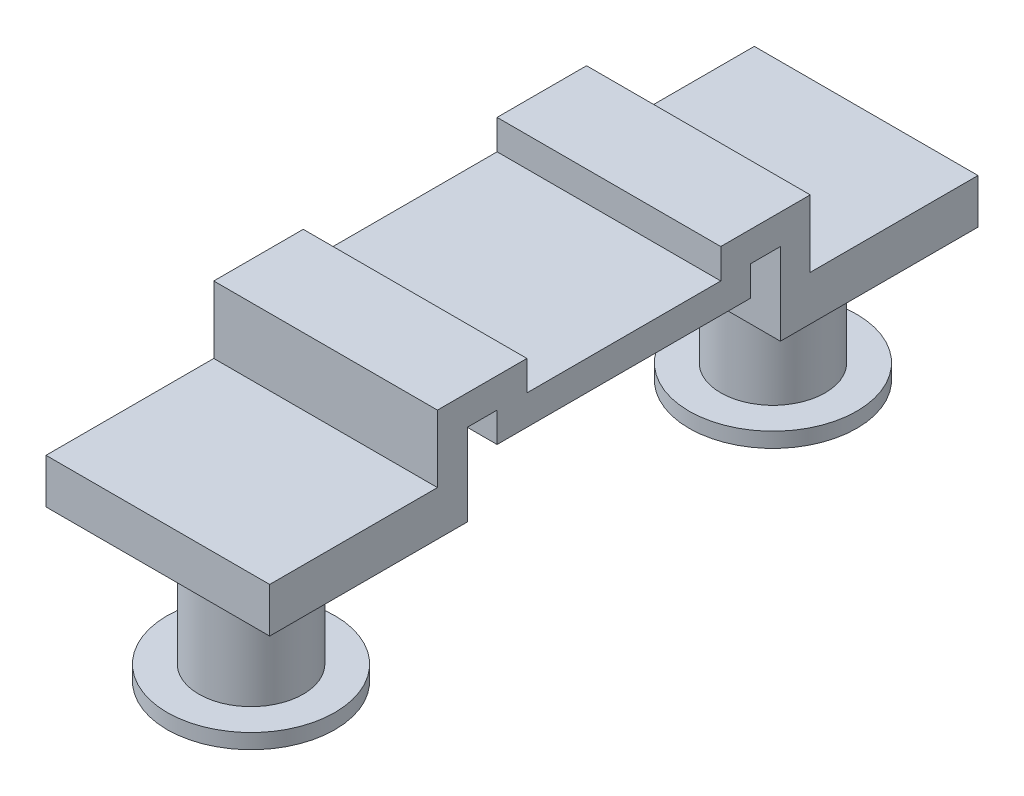
ISO-10303-21;
HEADER;
FILE_DESCRIPTION(('STEP AP214'),'2;1');
FILE_NAME('part.step','',(''),(''),'','','');
FILE_SCHEMA(('AUTOMOTIVE_DESIGN { 1 0 10303 214 1 1 1 1 }'));
ENDSEC;
DATA;
#1=APPLICATION_CONTEXT('core data for automotive mechanical design processes');
#2=APPLICATION_PROTOCOL_DEFINITION('international standard','automotive_design',2000,#1);
#3=PRODUCT_CONTEXT('',#1,'mechanical');
#4=PRODUCT('Part','Part','',(#3));
#5=PRODUCT_RELATED_PRODUCT_CATEGORY('part','',(#4));
#6=PRODUCT_DEFINITION_FORMATION('','',#4);
#7=PRODUCT_DEFINITION_CONTEXT('part definition',#1,'design');
#8=PRODUCT_DEFINITION('design','',#6,#7);
#9=PRODUCT_DEFINITION_SHAPE('','',#8);
#10=(LENGTH_UNIT() NAMED_UNIT(*) SI_UNIT(.MILLI.,.METRE.));
#11=(NAMED_UNIT(*) PLANE_ANGLE_UNIT() SI_UNIT($,.RADIAN.));
#12=(NAMED_UNIT(*) SI_UNIT($,.STERADIAN.) SOLID_ANGLE_UNIT());
#13=UNCERTAINTY_MEASURE_WITH_UNIT(LENGTH_MEASURE(1.E-05),#10,'distance_accuracy_value','');
#14=(GEOMETRIC_REPRESENTATION_CONTEXT(3) GLOBAL_UNCERTAINTY_ASSIGNED_CONTEXT((#13)) GLOBAL_UNIT_ASSIGNED_CONTEXT((#10,
#11,#12)) REPRESENTATION_CONTEXT('',''));
#15=CARTESIAN_POINT('',(0.,0.,0.));
#16=DIRECTION('',(0.,0.,1.));
#17=DIRECTION('',(1.,0.,0.));
#18=AXIS2_PLACEMENT_3D('',#15,#16,#17);
#19=CARTESIAN_POINT('',(3.,-1.,9.5));
#20=DIRECTION('',(0.,-1.,0.));
#21=DIRECTION('',(0.,0.,-1.));
#22=AXIS2_PLACEMENT_3D('',#19,#20,#21);
#23=PLANE('',#22);
#24=DIRECTION('',(0.,0.,1.));
#25=VECTOR('',#24,1.);
#26=CARTESIAN_POINT('',(-3.,-1.,9.5));
#27=LINE('',#26,#25);
#28=CARTESIAN_POINT('',(-3.,-1.,5.));
#29=VERTEX_POINT('',#28);
#30=CARTESIAN_POINT('',(-3.,-1.,9.5));
#31=VERTEX_POINT('',#30);
#32=EDGE_CURVE('E206',#29,#31,#27,.T.);
#33=ORIENTED_EDGE('',*,*,#32,.T.);
#34=DIRECTION('',(-1.,0.,0.));
#35=VECTOR('',#34,1.);
#36=CARTESIAN_POINT('',(3.,-1.,9.5));
#37=LINE('',#36,#35);
#38=CARTESIAN_POINT('',(3.,-1.,9.5));
#39=VERTEX_POINT('',#38);
#40=EDGE_CURVE('E11',#39,#31,#37,.T.);
#41=ORIENTED_EDGE('',*,*,#40,.F.);
#42=DIRECTION('',(0.,0.,1.));
#43=VECTOR('',#42,1.);
#44=CARTESIAN_POINT('',(3.,-1.,9.5));
#45=LINE('',#44,#43);
#46=CARTESIAN_POINT('',(3.,-1.,5.));
#47=VERTEX_POINT('',#46);
#48=EDGE_CURVE('E244',#47,#39,#45,.T.);
#49=ORIENTED_EDGE('',*,*,#48,.F.);
#50=DIRECTION('',(-1.,0.,0.));
#51=VECTOR('',#50,1.);
#52=CARTESIAN_POINT('',(3.,-1.,5.));
#53=LINE('',#52,#51);
#54=EDGE_CURVE('E202',#47,#29,#53,.T.);
#55=ORIENTED_EDGE('',*,*,#54,.T.);
#56=EDGE_LOOP('',(#33,#41,#49,#55));
#57=FACE_BOUND('',#56,.T.);
#58=ADVANCED_FACE('F37',(#57),#23,.F.);
#59=CARTESIAN_POINT('',(3.,-2.2,9.5));
#60=DIRECTION('',(0.,0.,-1.));
#61=DIRECTION('',(-1.,0.,0.));
#62=AXIS2_PLACEMENT_3D('',#59,#60,#61);
#63=PLANE('',#62);
#64=DIRECTION('',(0.,-1.,0.));
#65=VECTOR('',#64,1.);
#66=CARTESIAN_POINT('',(-3.,-2.2,9.5));
#67=LINE('',#66,#65);
#68=CARTESIAN_POINT('',(-3.,-2.2,9.5));
#69=VERTEX_POINT('',#68);
#70=EDGE_CURVE('E209',#31,#69,#67,.T.);
#71=ORIENTED_EDGE('',*,*,#70,.T.);
#72=DIRECTION('',(-1.,0.,0.));
#73=VECTOR('',#72,1.);
#74=CARTESIAN_POINT('',(3.,-2.2,9.5));
#75=LINE('',#74,#73);
#76=CARTESIAN_POINT('',(3.,-2.2,9.5));
#77=VERTEX_POINT('',#76);
#78=EDGE_CURVE('E46',#77,#69,#75,.T.);
#79=ORIENTED_EDGE('',*,*,#78,.F.);
#80=DIRECTION('',(0.,-1.,0.));
#81=VECTOR('',#80,1.);
#82=CARTESIAN_POINT('',(3.,-2.2,9.5));
#83=LINE('',#82,#81);
#84=EDGE_CURVE('E133',#39,#77,#83,.T.);
#85=ORIENTED_EDGE('',*,*,#84,.F.);
#86=ORIENTED_EDGE('',*,*,#40,.T.);
#87=EDGE_LOOP('',(#71,#79,#85,#86));
#88=FACE_BOUND('',#87,.T.);
#89=ADVANCED_FACE('F363',(#88),#63,.F.);
#90=CARTESIAN_POINT('',(3.,-2.2,4.2));
#91=DIRECTION('',(0.,1.,0.));
#92=DIRECTION('',(0.,0.,1.));
#93=AXIS2_PLACEMENT_3D('',#90,#91,#92);
#94=PLANE('',#93);
#95=CARTESIAN_POINT('',(0.,-2.2,7.));
#96=DIRECTION('',(0.,1.,0.));
#97=DIRECTION('',(0.,0.,1.));
#98=AXIS2_PLACEMENT_3D('',#95,#96,#97);
#99=CIRCLE('',#98,1.4);
#100=CARTESIAN_POINT('',(0.,-2.2,8.4));
#101=VERTEX_POINT('',#100);
#102=EDGE_CURVE('E40',#101,#101,#99,.T.);
#103=ORIENTED_EDGE('',*,*,#102,.T.);
#104=EDGE_LOOP('',(#103));
#105=FACE_BOUND('',#104,.T.);
#106=DIRECTION('',(0.,0.,-1.));
#107=VECTOR('',#106,1.);
#108=CARTESIAN_POINT('',(-3.,-2.2,4.2));
#109=LINE('',#108,#107);
#110=CARTESIAN_POINT('',(-3.,-2.2,4.2));
#111=VERTEX_POINT('',#110);
#112=EDGE_CURVE('E211',#69,#111,#109,.T.);
#113=ORIENTED_EDGE('',*,*,#112,.T.);
#114=DIRECTION('',(-1.,0.,0.));
#115=VECTOR('',#114,1.);
#116=CARTESIAN_POINT('',(3.,-2.2,4.2));
#117=LINE('',#116,#115);
#118=CARTESIAN_POINT('',(3.,-2.2,4.2));
#119=VERTEX_POINT('',#118);
#120=EDGE_CURVE('E287',#119,#111,#117,.T.);
#121=ORIENTED_EDGE('',*,*,#120,.F.);
#122=DIRECTION('',(0.,0.,-1.));
#123=VECTOR('',#122,1.);
#124=CARTESIAN_POINT('',(3.,-2.2,4.2));
#125=LINE('',#124,#123);
#126=EDGE_CURVE('E296',#77,#119,#125,.T.);
#127=ORIENTED_EDGE('',*,*,#126,.F.);
#128=ORIENTED_EDGE('',*,*,#78,.T.);
#129=EDGE_LOOP('',(#113,#121,#127,#128));
#130=FACE_BOUND('',#129,.T.);
#131=ADVANCED_FACE('F294',(#105,#130),#94,.F.);
#132=CARTESIAN_POINT('',(3.,0.,4.2));
#133=DIRECTION('',(0.,0.,1.));
#134=DIRECTION('',(1.,0.,0.));
#135=AXIS2_PLACEMENT_3D('',#132,#133,#134);
#136=PLANE('',#135);
#137=DIRECTION('',(0.,1.,0.));
#138=VECTOR('',#137,1.);
#139=CARTESIAN_POINT('',(-3.,0.,4.2));
#140=LINE('',#139,#138);
#141=CARTESIAN_POINT('',(-3.,0.,4.2));
#142=VERTEX_POINT('',#141);
#143=EDGE_CURVE('E213',#111,#142,#140,.T.);
#144=ORIENTED_EDGE('',*,*,#143,.T.);
#145=DIRECTION('',(-1.,0.,0.));
#146=VECTOR('',#145,1.);
#147=CARTESIAN_POINT('',(3.,0.,4.2));
#148=LINE('',#147,#146);
#149=CARTESIAN_POINT('',(3.,0.,4.2));
#150=VERTEX_POINT('',#149);
#151=EDGE_CURVE('E284',#150,#142,#148,.T.);
#152=ORIENTED_EDGE('',*,*,#151,.F.);
#153=DIRECTION('',(0.,1.,0.));
#154=VECTOR('',#153,1.);
#155=CARTESIAN_POINT('',(3.,0.,4.2));
#156=LINE('',#155,#154);
#157=EDGE_CURVE('E314',#119,#150,#156,.T.);
#158=ORIENTED_EDGE('',*,*,#157,.F.);
#159=ORIENTED_EDGE('',*,*,#120,.T.);
#160=EDGE_LOOP('',(#144,#152,#158,#159));
#161=FACE_BOUND('',#160,.T.);
#162=ADVANCED_FACE('F305',(#161),#136,.F.);
#163=CARTESIAN_POINT('',(3.,0.,4.2));
#164=DIRECTION('',(0.,1.,0.));
#165=DIRECTION('',(0.,0.,1.));
#166=AXIS2_PLACEMENT_3D('',#163,#164,#165);
#167=PLANE('',#166);
#168=DIRECTION('',(0.,0.,-1.));
#169=VECTOR('',#168,1.);
#170=CARTESIAN_POINT('',(-3.,0.,4.2));
#171=LINE('',#170,#169);
#172=CARTESIAN_POINT('',(-3.,0.,3.4));
#173=VERTEX_POINT('',#172);
#174=EDGE_CURVE('E215',#142,#173,#171,.T.);
#175=ORIENTED_EDGE('',*,*,#174,.T.);
#176=DIRECTION('',(-1.,0.,0.));
#177=VECTOR('',#176,1.);
#178=CARTESIAN_POINT('',(3.,0.,3.4));
#179=LINE('',#178,#177);
#180=CARTESIAN_POINT('',(3.,0.,3.4));
#181=VERTEX_POINT('',#180);
#182=EDGE_CURVE('E281',#181,#173,#179,.T.);
#183=ORIENTED_EDGE('',*,*,#182,.F.);
#184=DIRECTION('',(0.,0.,-1.));
#185=VECTOR('',#184,1.);
#186=CARTESIAN_POINT('',(3.,0.,4.2));
#187=LINE('',#186,#185);
#188=EDGE_CURVE('E311',#150,#181,#187,.T.);
#189=ORIENTED_EDGE('',*,*,#188,.F.);
#190=ORIENTED_EDGE('',*,*,#151,.T.);
#191=EDGE_LOOP('',(#175,#183,#189,#190));
#192=FACE_BOUND('',#191,.T.);
#193=ADVANCED_FACE('F309',(#192),#167,.F.);
#194=CARTESIAN_POINT('',(3.,0.,3.4));
#195=DIRECTION('',(0.,0.,-1.));
#196=DIRECTION('',(-1.,0.,0.));
#197=AXIS2_PLACEMENT_3D('',#194,#195,#196);
#198=PLANE('',#197);
#199=DIRECTION('',(0.,-1.,0.));
#200=VECTOR('',#199,1.);
#201=CARTESIAN_POINT('',(-3.,0.,3.4));
#202=LINE('',#201,#200);
#203=CARTESIAN_POINT('',(-3.,-0.799999999999999,3.4));
#204=VERTEX_POINT('',#203);
#205=EDGE_CURVE('E217',#173,#204,#202,.T.);
#206=ORIENTED_EDGE('',*,*,#205,.T.);
#207=DIRECTION('',(-1.,0.,0.));
#208=VECTOR('',#207,1.);
#209=CARTESIAN_POINT('',(3.,-0.799999999999999,3.4));
#210=LINE('',#209,#208);
#211=CARTESIAN_POINT('',(3.,-0.799999999999999,3.4));
#212=VERTEX_POINT('',#211);
#213=EDGE_CURVE('E278',#212,#204,#210,.T.);
#214=ORIENTED_EDGE('',*,*,#213,.F.);
#215=DIRECTION('',(0.,-1.,0.));
#216=VECTOR('',#215,1.);
#217=CARTESIAN_POINT('',(3.,0.,3.4));
#218=LINE('',#217,#216);
#219=EDGE_CURVE('E313',#181,#212,#218,.T.);
#220=ORIENTED_EDGE('',*,*,#219,.F.);
#221=ORIENTED_EDGE('',*,*,#182,.T.);
#222=EDGE_LOOP('',(#206,#214,#220,#221));
#223=FACE_BOUND('',#222,.T.);
#224=ADVANCED_FACE('F377',(#223),#198,.F.);
#225=CARTESIAN_POINT('',(3.,-0.799999999999999,3.4));
#226=DIRECTION('',(0.,1.,0.));
#227=DIRECTION('',(0.,0.,1.));
#228=AXIS2_PLACEMENT_3D('',#225,#226,#227);
#229=PLANE('',#228);
#230=DIRECTION('',(0.,0.,-1.));
#231=VECTOR('',#230,1.);
#232=CARTESIAN_POINT('',(-3.,-0.799999999999999,3.4));
#233=LINE('',#232,#231);
#234=CARTESIAN_POINT('',(-3.,-0.799999999999999,-3.4));
#235=VERTEX_POINT('',#234);
#236=EDGE_CURVE('E219',#204,#235,#233,.T.);
#237=ORIENTED_EDGE('',*,*,#236,.T.);
#238=DIRECTION('',(-1.,0.,0.));
#239=VECTOR('',#238,1.);
#240=CARTESIAN_POINT('',(3.,-0.799999999999999,-3.4));
#241=LINE('',#240,#239);
#242=CARTESIAN_POINT('',(3.,-0.799999999999999,-3.4));
#243=VERTEX_POINT('',#242);
#244=EDGE_CURVE('E275',#243,#235,#241,.T.);
#245=ORIENTED_EDGE('',*,*,#244,.F.);
#246=DIRECTION('',(0.,0.,-1.));
#247=VECTOR('',#246,1.);
#248=CARTESIAN_POINT('',(3.,-0.799999999999999,3.4));
#249=LINE('',#248,#247);
#250=EDGE_CURVE('E316',#212,#243,#249,.T.);
#251=ORIENTED_EDGE('',*,*,#250,.F.);
#252=ORIENTED_EDGE('',*,*,#213,.T.);
#253=EDGE_LOOP('',(#237,#245,#251,#252));
#254=FACE_BOUND('',#253,.T.);
#255=ADVANCED_FACE('F380',(#254),#229,.F.);
#256=CARTESIAN_POINT('',(3.,0.,-3.4));
#257=DIRECTION('',(0.,0.,1.));
#258=DIRECTION('',(1.,0.,0.));
#259=AXIS2_PLACEMENT_3D('',#256,#257,#258);
#260=PLANE('',#259);
#261=DIRECTION('',(0.,1.,0.));
#262=VECTOR('',#261,1.);
#263=CARTESIAN_POINT('',(-3.,0.,-3.4));
#264=LINE('',#263,#262);
#265=CARTESIAN_POINT('',(-3.,0.,-3.4));
#266=VERTEX_POINT('',#265);
#267=EDGE_CURVE('E221',#235,#266,#264,.T.);
#268=ORIENTED_EDGE('',*,*,#267,.T.);
#269=DIRECTION('',(-1.,0.,0.));
#270=VECTOR('',#269,1.);
#271=CARTESIAN_POINT('',(3.,0.,-3.4));
#272=LINE('',#271,#270);
#273=CARTESIAN_POINT('',(3.,0.,-3.4));
#274=VERTEX_POINT('',#273);
#275=EDGE_CURVE('E272',#274,#266,#272,.T.);
#276=ORIENTED_EDGE('',*,*,#275,.F.);
#277=DIRECTION('',(0.,1.,0.));
#278=VECTOR('',#277,1.);
#279=CARTESIAN_POINT('',(3.,0.,-3.4));
#280=LINE('',#279,#278);
#281=EDGE_CURVE('E322',#243,#274,#280,.T.);
#282=ORIENTED_EDGE('',*,*,#281,.F.);
#283=ORIENTED_EDGE('',*,*,#244,.T.);
#284=EDGE_LOOP('',(#268,#276,#282,#283));
#285=FACE_BOUND('',#284,.T.);
#286=ADVANCED_FACE('F384',(#285),#260,.F.);
#287=CARTESIAN_POINT('',(3.,0.,-4.2));
#288=DIRECTION('',(0.,1.,0.));
#289=DIRECTION('',(0.,0.,1.));
#290=AXIS2_PLACEMENT_3D('',#287,#288,#289);
#291=PLANE('',#290);
#292=DIRECTION('',(0.,0.,-1.));
#293=VECTOR('',#292,1.);
#294=CARTESIAN_POINT('',(-3.,0.,-4.2));
#295=LINE('',#294,#293);
#296=CARTESIAN_POINT('',(-3.,0.,-4.2));
#297=VERTEX_POINT('',#296);
#298=EDGE_CURVE('E223',#266,#297,#295,.T.);
#299=ORIENTED_EDGE('',*,*,#298,.T.);
#300=DIRECTION('',(-1.,0.,0.));
#301=VECTOR('',#300,1.);
#302=CARTESIAN_POINT('',(3.,0.,-4.2));
#303=LINE('',#302,#301);
#304=CARTESIAN_POINT('',(3.,0.,-4.2));
#305=VERTEX_POINT('',#304);
#306=EDGE_CURVE('E269',#305,#297,#303,.T.);
#307=ORIENTED_EDGE('',*,*,#306,.F.);
#308=DIRECTION('',(0.,0.,-1.));
#309=VECTOR('',#308,1.);
#310=CARTESIAN_POINT('',(3.,0.,-4.2));
#311=LINE('',#310,#309);
#312=EDGE_CURVE('E324',#274,#305,#311,.T.);
#313=ORIENTED_EDGE('',*,*,#312,.F.);
#314=ORIENTED_EDGE('',*,*,#275,.T.);
#315=EDGE_LOOP('',(#299,#307,#313,#314));
#316=FACE_BOUND('',#315,.T.);
#317=ADVANCED_FACE('F388',(#316),#291,.F.);
#318=CARTESIAN_POINT('',(3.,0.,-4.2));
#319=DIRECTION('',(0.,0.,-1.));
#320=DIRECTION('',(-1.,0.,0.));
#321=AXIS2_PLACEMENT_3D('',#318,#319,#320);
#322=PLANE('',#321);
#323=DIRECTION('',(0.,-1.,0.));
#324=VECTOR('',#323,1.);
#325=CARTESIAN_POINT('',(-3.,0.,-4.2));
#326=LINE('',#325,#324);
#327=CARTESIAN_POINT('',(-3.,-2.2,-4.2));
#328=VERTEX_POINT('',#327);
#329=EDGE_CURVE('E225',#297,#328,#326,.T.);
#330=ORIENTED_EDGE('',*,*,#329,.T.);
#331=DIRECTION('',(-1.,0.,0.));
#332=VECTOR('',#331,1.);
#333=CARTESIAN_POINT('',(3.,-2.2,-4.2));
#334=LINE('',#333,#332);
#335=CARTESIAN_POINT('',(3.,-2.2,-4.2));
#336=VERTEX_POINT('',#335);
#337=EDGE_CURVE('E266',#336,#328,#334,.T.);
#338=ORIENTED_EDGE('',*,*,#337,.F.);
#339=DIRECTION('',(0.,-1.,0.));
#340=VECTOR('',#339,1.);
#341=CARTESIAN_POINT('',(3.,0.,-4.2));
#342=LINE('',#341,#340);
#343=EDGE_CURVE('E326',#305,#336,#342,.T.);
#344=ORIENTED_EDGE('',*,*,#343,.F.);
#345=ORIENTED_EDGE('',*,*,#306,.T.);
#346=EDGE_LOOP('',(#330,#338,#344,#345));
#347=FACE_BOUND('',#346,.T.);
#348=ADVANCED_FACE('F392',(#347),#322,.F.);
#349=CARTESIAN_POINT('',(3.,-2.2,-4.2));
#350=DIRECTION('',(0.,1.,0.));
#351=DIRECTION('',(0.,0.,1.));
#352=AXIS2_PLACEMENT_3D('',#349,#350,#351);
#353=PLANE('',#352);
#354=CARTESIAN_POINT('',(0.,-2.2,-7.));
#355=DIRECTION('',(0.,1.,0.));
#356=DIRECTION('',(0.,0.,1.));
#357=AXIS2_PLACEMENT_3D('',#354,#355,#356);
#358=CIRCLE('',#357,1.4);
#359=CARTESIAN_POINT('',(0.,-2.2,-5.6));
#360=VERTEX_POINT('',#359);
#361=EDGE_CURVE('E712',#360,#360,#358,.T.);
#362=ORIENTED_EDGE('',*,*,#361,.T.);
#363=EDGE_LOOP('',(#362));
#364=FACE_BOUND('',#363,.T.);
#365=DIRECTION('',(0.,0.,-1.));
#366=VECTOR('',#365,1.);
#367=CARTESIAN_POINT('',(-3.,-2.2,-4.2));
#368=LINE('',#367,#366);
#369=CARTESIAN_POINT('',(-3.,-2.2,-9.5));
#370=VERTEX_POINT('',#369);
#371=EDGE_CURVE('E227',#328,#370,#368,.T.);
#372=ORIENTED_EDGE('',*,*,#371,.T.);
#373=DIRECTION('',(-1.,0.,0.));
#374=VECTOR('',#373,1.);
#375=CARTESIAN_POINT('',(3.,-2.2,-9.5));
#376=LINE('',#375,#374);
#377=CARTESIAN_POINT('',(3.,-2.2,-9.5));
#378=VERTEX_POINT('',#377);
#379=EDGE_CURVE('E263',#378,#370,#376,.T.);
#380=ORIENTED_EDGE('',*,*,#379,.F.);
#381=DIRECTION('',(0.,0.,-1.));
#382=VECTOR('',#381,1.);
#383=CARTESIAN_POINT('',(3.,-2.2,-4.2));
#384=LINE('',#383,#382);
#385=EDGE_CURVE('E328',#336,#378,#384,.T.);
#386=ORIENTED_EDGE('',*,*,#385,.F.);
#387=ORIENTED_EDGE('',*,*,#337,.T.);
#388=EDGE_LOOP('',(#372,#380,#386,#387));
#389=FACE_BOUND('',#388,.T.);
#390=ADVANCED_FACE('F396',(#364,#389),#353,.F.);
#391=CARTESIAN_POINT('',(3.,-2.2,-9.5));
#392=DIRECTION('',(0.,0.,1.));
#393=DIRECTION('',(1.,0.,0.));
#394=AXIS2_PLACEMENT_3D('',#391,#392,#393);
#395=PLANE('',#394);
#396=DIRECTION('',(0.,1.,0.));
#397=VECTOR('',#396,1.);
#398=CARTESIAN_POINT('',(-3.,-2.2,-9.5));
#399=LINE('',#398,#397);
#400=CARTESIAN_POINT('',(-3.,-1.,-9.5));
#401=VERTEX_POINT('',#400);
#402=EDGE_CURVE('E229',#370,#401,#399,.T.);
#403=ORIENTED_EDGE('',*,*,#402,.T.);
#404=DIRECTION('',(-1.,0.,0.));
#405=VECTOR('',#404,1.);
#406=CARTESIAN_POINT('',(3.,-1.,-9.5));
#407=LINE('',#406,#405);
#408=CARTESIAN_POINT('',(3.,-1.,-9.5));
#409=VERTEX_POINT('',#408);
#410=EDGE_CURVE('E260',#409,#401,#407,.T.);
#411=ORIENTED_EDGE('',*,*,#410,.F.);
#412=DIRECTION('',(0.,1.,0.));
#413=VECTOR('',#412,1.);
#414=CARTESIAN_POINT('',(3.,-2.2,-9.5));
#415=LINE('',#414,#413);
#416=EDGE_CURVE('E330',#378,#409,#415,.T.);
#417=ORIENTED_EDGE('',*,*,#416,.F.);
#418=ORIENTED_EDGE('',*,*,#379,.T.);
#419=EDGE_LOOP('',(#403,#411,#417,#418));
#420=FACE_BOUND('',#419,.T.);
#421=ADVANCED_FACE('F400',(#420),#395,.F.);
#422=CARTESIAN_POINT('',(3.,-1.,-9.5));
#423=DIRECTION('',(0.,-1.,0.));
#424=DIRECTION('',(0.,0.,-1.));
#425=AXIS2_PLACEMENT_3D('',#422,#423,#424);
#426=PLANE('',#425);
#427=DIRECTION('',(0.,0.,1.));
#428=VECTOR('',#427,1.);
#429=CARTESIAN_POINT('',(-3.,-1.,-9.5));
#430=LINE('',#429,#428);
#431=CARTESIAN_POINT('',(-3.,-1.,-5.));
#432=VERTEX_POINT('',#431);
#433=EDGE_CURVE('E231',#401,#432,#430,.T.);
#434=ORIENTED_EDGE('',*,*,#433,.T.);
#435=DIRECTION('',(-1.,0.,0.));
#436=VECTOR('',#435,1.);
#437=CARTESIAN_POINT('',(3.,-1.,-5.));
#438=LINE('',#437,#436);
#439=CARTESIAN_POINT('',(3.,-1.,-5.));
#440=VERTEX_POINT('',#439);
#441=EDGE_CURVE('E257',#440,#432,#438,.T.);
#442=ORIENTED_EDGE('',*,*,#441,.F.);
#443=DIRECTION('',(0.,0.,1.));
#444=VECTOR('',#443,1.);
#445=CARTESIAN_POINT('',(3.,-1.,-9.5));
#446=LINE('',#445,#444);
#447=EDGE_CURVE('E332',#409,#440,#446,.T.);
#448=ORIENTED_EDGE('',*,*,#447,.F.);
#449=ORIENTED_EDGE('',*,*,#410,.T.);
#450=EDGE_LOOP('',(#434,#442,#448,#449));
#451=FACE_BOUND('',#450,.T.);
#452=ADVANCED_FACE('F404',(#451),#426,.F.);
#453=CARTESIAN_POINT('',(3.,-1.,-5.));
#454=DIRECTION('',(0.,0.,1.));
#455=DIRECTION('',(1.,0.,0.));
#456=AXIS2_PLACEMENT_3D('',#453,#454,#455);
#457=PLANE('',#456);
#458=DIRECTION('',(0.,1.,0.));
#459=VECTOR('',#458,1.);
#460=CARTESIAN_POINT('',(-3.,-1.,-5.));
#461=LINE('',#460,#459);
#462=CARTESIAN_POINT('',(-3.,0.8,-5.));
#463=VERTEX_POINT('',#462);
#464=EDGE_CURVE('E233',#432,#463,#461,.T.);
#465=ORIENTED_EDGE('',*,*,#464,.T.);
#466=DIRECTION('',(-1.,0.,0.));
#467=VECTOR('',#466,1.);
#468=CARTESIAN_POINT('',(3.,0.8,-5.));
#469=LINE('',#468,#467);
#470=CARTESIAN_POINT('',(3.,0.8,-5.));
#471=VERTEX_POINT('',#470);
#472=EDGE_CURVE('E254',#471,#463,#469,.T.);
#473=ORIENTED_EDGE('',*,*,#472,.F.);
#474=DIRECTION('',(0.,1.,0.));
#475=VECTOR('',#474,1.);
#476=CARTESIAN_POINT('',(3.,-1.,-5.));
#477=LINE('',#476,#475);
#478=EDGE_CURVE('E334',#440,#471,#477,.T.);
#479=ORIENTED_EDGE('',*,*,#478,.F.);
#480=ORIENTED_EDGE('',*,*,#441,.T.);
#481=EDGE_LOOP('',(#465,#473,#479,#480));
#482=FACE_BOUND('',#481,.T.);
#483=ADVANCED_FACE('F408',(#482),#457,.F.);
#484=CARTESIAN_POINT('',(3.,0.8,-5.));
#485=DIRECTION('',(0.,-1.,0.));
#486=DIRECTION('',(0.,0.,-1.));
#487=AXIS2_PLACEMENT_3D('',#484,#485,#486);
#488=PLANE('',#487);
#489=DIRECTION('',(0.,0.,1.));
#490=VECTOR('',#489,1.);
#491=CARTESIAN_POINT('',(-3.,0.8,-5.));
#492=LINE('',#491,#490);
#493=CARTESIAN_POINT('',(-3.,0.8,-2.6));
#494=VERTEX_POINT('',#493);
#495=EDGE_CURVE('E235',#463,#494,#492,.T.);
#496=ORIENTED_EDGE('',*,*,#495,.T.);
#497=DIRECTION('',(-1.,0.,0.));
#498=VECTOR('',#497,1.);
#499=CARTESIAN_POINT('',(3.,0.8,-2.6));
#500=LINE('',#499,#498);
#501=CARTESIAN_POINT('',(3.,0.8,-2.6));
#502=VERTEX_POINT('',#501);
#503=EDGE_CURVE('E251',#502,#494,#500,.T.);
#504=ORIENTED_EDGE('',*,*,#503,.F.);
#505=DIRECTION('',(0.,0.,1.));
#506=VECTOR('',#505,1.);
#507=CARTESIAN_POINT('',(3.,0.8,-5.));
#508=LINE('',#507,#506);
#509=EDGE_CURVE('E336',#471,#502,#508,.T.);
#510=ORIENTED_EDGE('',*,*,#509,.F.);
#511=ORIENTED_EDGE('',*,*,#472,.T.);
#512=EDGE_LOOP('',(#496,#504,#510,#511));
#513=FACE_BOUND('',#512,.T.);
#514=ADVANCED_FACE('F412',(#513),#488,.F.);
#515=CARTESIAN_POINT('',(3.,0.8,-2.6));
#516=DIRECTION('',(0.,0.,-1.));
#517=DIRECTION('',(-1.,0.,0.));
#518=AXIS2_PLACEMENT_3D('',#515,#516,#517);
#519=PLANE('',#518);
#520=DIRECTION('',(0.,-1.,0.));
#521=VECTOR('',#520,1.);
#522=CARTESIAN_POINT('',(-3.,0.8,-2.6));
#523=LINE('',#522,#521);
#524=CARTESIAN_POINT('',(-3.,0.,-2.6));
#525=VERTEX_POINT('',#524);
#526=EDGE_CURVE('E237',#494,#525,#523,.T.);
#527=ORIENTED_EDGE('',*,*,#526,.T.);
#528=DIRECTION('',(-1.,0.,0.));
#529=VECTOR('',#528,1.);
#530=CARTESIAN_POINT('',(3.,0.,-2.6));
#531=LINE('',#530,#529);
#532=CARTESIAN_POINT('',(3.,0.,-2.6));
#533=VERTEX_POINT('',#532);
#534=EDGE_CURVE('E248',#533,#525,#531,.T.);
#535=ORIENTED_EDGE('',*,*,#534,.F.);
#536=DIRECTION('',(0.,-1.,0.));
#537=VECTOR('',#536,1.);
#538=CARTESIAN_POINT('',(3.,0.8,-2.6));
#539=LINE('',#538,#537);
#540=EDGE_CURVE('E338',#502,#533,#539,.T.);
#541=ORIENTED_EDGE('',*,*,#540,.F.);
#542=ORIENTED_EDGE('',*,*,#503,.T.);
#543=EDGE_LOOP('',(#527,#535,#541,#542));
#544=FACE_BOUND('',#543,.T.);
#545=ADVANCED_FACE('F344',(#544),#519,.F.);
#546=CARTESIAN_POINT('',(3.,0.,2.6));
#547=DIRECTION('',(0.,-1.,0.));
#548=DIRECTION('',(0.,0.,-1.));
#549=AXIS2_PLACEMENT_3D('',#546,#547,#548);
#550=PLANE('',#549);
#551=DIRECTION('',(0.,0.,1.));
#552=VECTOR('',#551,1.);
#553=CARTESIAN_POINT('',(-3.,0.,2.6));
#554=LINE('',#553,#552);
#555=CARTESIAN_POINT('',(-3.,0.,2.6));
#556=VERTEX_POINT('',#555);
#557=EDGE_CURVE('E239',#525,#556,#554,.T.);
#558=ORIENTED_EDGE('',*,*,#557,.T.);
#559=DIRECTION('',(-1.,0.,0.));
#560=VECTOR('',#559,1.);
#561=CARTESIAN_POINT('',(3.,0.,2.6));
#562=LINE('',#561,#560);
#563=CARTESIAN_POINT('',(3.,0.,2.6));
#564=VERTEX_POINT('',#563);
#565=EDGE_CURVE('E197',#564,#556,#562,.T.);
#566=ORIENTED_EDGE('',*,*,#565,.F.);
#567=DIRECTION('',(0.,0.,1.));
#568=VECTOR('',#567,1.);
#569=CARTESIAN_POINT('',(3.,0.,2.6));
#570=LINE('',#569,#568);
#571=EDGE_CURVE('E188',#533,#564,#570,.T.);
#572=ORIENTED_EDGE('',*,*,#571,.F.);
#573=ORIENTED_EDGE('',*,*,#534,.T.);
#574=EDGE_LOOP('',(#558,#566,#572,#573));
#575=FACE_BOUND('',#574,.T.);
#576=ADVANCED_FACE('F348',(#575),#550,.F.);
#577=CARTESIAN_POINT('',(3.,0.8,2.6));
#578=DIRECTION('',(0.,0.,1.));
#579=DIRECTION('',(1.,0.,0.));
#580=AXIS2_PLACEMENT_3D('',#577,#578,#579);
#581=PLANE('',#580);
#582=DIRECTION('',(0.,1.,0.));
#583=VECTOR('',#582,1.);
#584=CARTESIAN_POINT('',(-3.,0.8,2.6));
#585=LINE('',#584,#583);
#586=CARTESIAN_POINT('',(-3.,0.8,2.6));
#587=VERTEX_POINT('',#586);
#588=EDGE_CURVE('E196',#556,#587,#585,.T.);
#589=ORIENTED_EDGE('',*,*,#588,.T.);
#590=DIRECTION('',(-1.,0.,0.));
#591=VECTOR('',#590,1.);
#592=CARTESIAN_POINT('',(3.,0.8,2.6));
#593=LINE('',#592,#591);
#594=CARTESIAN_POINT('',(3.,0.8,2.6));
#595=VERTEX_POINT('',#594);
#596=EDGE_CURVE('E193',#595,#587,#593,.T.);
#597=ORIENTED_EDGE('',*,*,#596,.F.);
#598=DIRECTION('',(0.,1.,0.));
#599=VECTOR('',#598,1.);
#600=CARTESIAN_POINT('',(3.,0.8,2.6));
#601=LINE('',#600,#599);
#602=EDGE_CURVE('E182',#564,#595,#601,.T.);
#603=ORIENTED_EDGE('',*,*,#602,.F.);
#604=ORIENTED_EDGE('',*,*,#565,.T.);
#605=EDGE_LOOP('',(#589,#597,#603,#604));
#606=FACE_BOUND('',#605,.T.);
#607=ADVANCED_FACE('F194',(#606),#581,.F.);
#608=CARTESIAN_POINT('',(3.,0.8,5.));
#609=DIRECTION('',(0.,-1.,0.));
#610=DIRECTION('',(0.,0.,-1.));
#611=AXIS2_PLACEMENT_3D('',#608,#609,#610);
#612=PLANE('',#611);
#613=DIRECTION('',(0.,0.,1.));
#614=VECTOR('',#613,1.);
#615=CARTESIAN_POINT('',(-3.,0.8,5.));
#616=LINE('',#615,#614);
#617=CARTESIAN_POINT('',(-3.,0.8,5.));
#618=VERTEX_POINT('',#617);
#619=EDGE_CURVE('E119',#587,#618,#616,.T.);
#620=ORIENTED_EDGE('',*,*,#619,.T.);
#621=DIRECTION('',(-1.,0.,0.));
#622=VECTOR('',#621,1.);
#623=CARTESIAN_POINT('',(3.,0.8,5.));
#624=LINE('',#623,#622);
#625=CARTESIAN_POINT('',(3.,0.8,5.));
#626=VERTEX_POINT('',#625);
#627=EDGE_CURVE('E198',#626,#618,#624,.T.);
#628=ORIENTED_EDGE('',*,*,#627,.F.);
#629=DIRECTION('',(0.,0.,1.));
#630=VECTOR('',#629,1.);
#631=CARTESIAN_POINT('',(3.,0.8,5.));
#632=LINE('',#631,#630);
#633=EDGE_CURVE('E186',#595,#626,#632,.T.);
#634=ORIENTED_EDGE('',*,*,#633,.F.);
#635=ORIENTED_EDGE('',*,*,#596,.T.);
#636=EDGE_LOOP('',(#620,#628,#634,#635));
#637=FACE_BOUND('',#636,.T.);
#638=ADVANCED_FACE('F200',(#637),#612,.F.);
#639=CARTESIAN_POINT('',(3.,-1.,5.));
#640=DIRECTION('',(0.,0.,-1.));
#641=DIRECTION('',(-1.,0.,0.));
#642=AXIS2_PLACEMENT_3D('',#639,#640,#641);
#643=PLANE('',#642);
#644=DIRECTION('',(0.,-1.,0.));
#645=VECTOR('',#644,1.);
#646=CARTESIAN_POINT('',(-3.,-1.,5.));
#647=LINE('',#646,#645);
#648=EDGE_CURVE('E125',#618,#29,#647,.T.);
#649=ORIENTED_EDGE('',*,*,#648,.T.);
#650=ORIENTED_EDGE('',*,*,#54,.F.);
#651=DIRECTION('',(0.,-1.,0.));
#652=VECTOR('',#651,1.);
#653=CARTESIAN_POINT('',(3.,-1.,5.));
#654=LINE('',#653,#652);
#655=EDGE_CURVE('E54',#626,#47,#654,.T.);
#656=ORIENTED_EDGE('',*,*,#655,.F.);
#657=ORIENTED_EDGE('',*,*,#627,.T.);
#658=EDGE_LOOP('',(#649,#650,#656,#657));
#659=FACE_BOUND('',#658,.T.);
#660=ADVANCED_FACE('F352',(#659),#643,.F.);
#661=CARTESIAN_POINT('',(3.,0.,0.));
#662=DIRECTION('',(1.,0.,0.));
#663=DIRECTION('',(0.,0.,-1.));
#664=AXIS2_PLACEMENT_3D('',#661,#662,#663);
#665=PLANE('',#664);
#666=ORIENTED_EDGE('',*,*,#48,.T.);
#667=ORIENTED_EDGE('',*,*,#84,.T.);
#668=ORIENTED_EDGE('',*,*,#126,.T.);
#669=ORIENTED_EDGE('',*,*,#157,.T.);
#670=ORIENTED_EDGE('',*,*,#188,.T.);
#671=ORIENTED_EDGE('',*,*,#219,.T.);
#672=ORIENTED_EDGE('',*,*,#250,.T.);
#673=ORIENTED_EDGE('',*,*,#281,.T.);
#674=ORIENTED_EDGE('',*,*,#312,.T.);
#675=ORIENTED_EDGE('',*,*,#343,.T.);
#676=ORIENTED_EDGE('',*,*,#385,.T.);
#677=ORIENTED_EDGE('',*,*,#416,.T.);
#678=ORIENTED_EDGE('',*,*,#447,.T.);
#679=ORIENTED_EDGE('',*,*,#478,.T.);
#680=ORIENTED_EDGE('',*,*,#509,.T.);
#681=ORIENTED_EDGE('',*,*,#540,.T.);
#682=ORIENTED_EDGE('',*,*,#571,.T.);
#683=ORIENTED_EDGE('',*,*,#602,.T.);
#684=ORIENTED_EDGE('',*,*,#633,.T.);
#685=ORIENTED_EDGE('',*,*,#655,.T.);
#686=EDGE_LOOP('',(#666,#667,#668,#669,#670,#671,#672,#673,#674,#675,#676,#677,#678,#679,#680,
#681,#682,#683,#684,#685));
#687=FACE_BOUND('',#686,.T.);
#688=ADVANCED_FACE('F184',(#687),#665,.T.);
#689=CARTESIAN_POINT('',(-3.,0.,0.));
#690=DIRECTION('',(1.,0.,0.));
#691=DIRECTION('',(0.,0.,-1.));
#692=AXIS2_PLACEMENT_3D('',#689,#690,#691);
#693=PLANE('',#692);
#694=ORIENTED_EDGE('',*,*,#32,.F.);
#695=ORIENTED_EDGE('',*,*,#648,.F.);
#696=ORIENTED_EDGE('',*,*,#619,.F.);
#697=ORIENTED_EDGE('',*,*,#588,.F.);
#698=ORIENTED_EDGE('',*,*,#557,.F.);
#699=ORIENTED_EDGE('',*,*,#526,.F.);
#700=ORIENTED_EDGE('',*,*,#495,.F.);
#701=ORIENTED_EDGE('',*,*,#464,.F.);
#702=ORIENTED_EDGE('',*,*,#433,.F.);
#703=ORIENTED_EDGE('',*,*,#402,.F.);
#704=ORIENTED_EDGE('',*,*,#371,.F.);
#705=ORIENTED_EDGE('',*,*,#329,.F.);
#706=ORIENTED_EDGE('',*,*,#298,.F.);
#707=ORIENTED_EDGE('',*,*,#267,.F.);
#708=ORIENTED_EDGE('',*,*,#236,.F.);
#709=ORIENTED_EDGE('',*,*,#205,.F.);
#710=ORIENTED_EDGE('',*,*,#174,.F.);
#711=ORIENTED_EDGE('',*,*,#143,.F.);
#712=ORIENTED_EDGE('',*,*,#112,.F.);
#713=ORIENTED_EDGE('',*,*,#70,.F.);
#714=EDGE_LOOP('',(#694,#695,#696,#697,#698,#699,#700,#701,#702,#703,#704,#705,#706,#707,#708,
#709,#710,#711,#712,#713));
#715=FACE_BOUND('',#714,.T.);
#716=ADVANCED_FACE('F300',(#715),#693,.F.);
#717=CARTESIAN_POINT('',(0.,-5.6,7.));
#718=DIRECTION('',(0.,1.,0.));
#719=DIRECTION('',(0.,0.,1.));
#720=AXIS2_PLACEMENT_3D('',#717,#718,#719);
#721=CYLINDRICAL_SURFACE('',#720,1.4);
#722=CARTESIAN_POINT('',(0.,-5.6,7.));
#723=DIRECTION('',(0.,1.,0.));
#724=DIRECTION('',(0.,0.,1.));
#725=AXIS2_PLACEMENT_3D('',#722,#723,#724);
#726=CIRCLE('',#725,1.4);
#727=CARTESIAN_POINT('',(0.,-5.6,8.4));
#728=VERTEX_POINT('',#727);
#729=EDGE_CURVE('E692',#728,#728,#726,.T.);
#730=ORIENTED_EDGE('',*,*,#729,.T.);
#731=EDGE_LOOP('',(#730));
#732=FACE_BOUND('',#731,.T.);
#733=ORIENTED_EDGE('',*,*,#102,.F.);
#734=EDGE_LOOP('',(#733));
#735=FACE_BOUND('',#734,.T.);
#736=ADVANCED_FACE('F451',(#732,#735),#721,.T.);
#737=CARTESIAN_POINT('',(0.,-5.6,-7.));
#738=DIRECTION('',(0.,1.,0.));
#739=DIRECTION('',(0.,0.,1.));
#740=AXIS2_PLACEMENT_3D('',#737,#738,#739);
#741=CYLINDRICAL_SURFACE('',#740,1.4);
#742=CARTESIAN_POINT('',(0.,-5.6,-7.));
#743=DIRECTION('',(0.,1.,0.));
#744=DIRECTION('',(0.,0.,-1.));
#745=AXIS2_PLACEMENT_3D('',#742,#743,#744);
#746=CIRCLE('',#745,1.4);
#747=CARTESIAN_POINT('',(0.,-5.6,-8.4));
#748=VERTEX_POINT('',#747);
#749=EDGE_CURVE('E707',#748,#748,#746,.T.);
#750=ORIENTED_EDGE('',*,*,#749,.T.);
#751=EDGE_LOOP('',(#750));
#752=FACE_BOUND('',#751,.T.);
#753=ORIENTED_EDGE('',*,*,#361,.F.);
#754=EDGE_LOOP('',(#753));
#755=FACE_BOUND('',#754,.T.);
#756=ADVANCED_FACE('F492',(#752,#755),#741,.T.);
#757=CARTESIAN_POINT('',(0.,-6.,-7.));
#758=DIRECTION('',(0.,1.,0.));
#759=DIRECTION('',(0.,0.,1.));
#760=AXIS2_PLACEMENT_3D('',#757,#758,#759);
#761=CYLINDRICAL_SURFACE('',#760,2.25);
#762=CARTESIAN_POINT('',(0.,-6.,-7.));
#763=DIRECTION('',(0.,-1.,0.));
#764=DIRECTION('',(0.,0.,-1.));
#765=AXIS2_PLACEMENT_3D('',#762,#763,#764);
#766=CIRCLE('',#765,2.25);
#767=CARTESIAN_POINT('',(0.,-6.,-9.25));
#768=VERTEX_POINT('',#767);
#769=EDGE_CURVE('E704',#768,#768,#766,.T.);
#770=ORIENTED_EDGE('',*,*,#769,.F.);
#771=EDGE_LOOP('',(#770));
#772=FACE_BOUND('',#771,.T.);
#773=CARTESIAN_POINT('',(0.,-5.6,-7.));
#774=DIRECTION('',(0.,-1.,0.));
#775=DIRECTION('',(0.,0.,-1.));
#776=AXIS2_PLACEMENT_3D('',#773,#774,#775);
#777=CIRCLE('',#776,2.25);
#778=CARTESIAN_POINT('',(0.,-5.6,-9.25));
#779=VERTEX_POINT('',#778);
#780=EDGE_CURVE('E699',#779,#779,#777,.T.);
#781=ORIENTED_EDGE('',*,*,#780,.T.);
#782=EDGE_LOOP('',(#781));
#783=FACE_BOUND('',#782,.T.);
#784=ADVANCED_FACE('F503',(#772,#783),#761,.T.);
#785=CARTESIAN_POINT('',(0.,-6.,-7.));
#786=DIRECTION('',(0.,-1.,0.));
#787=DIRECTION('',(0.,0.,-1.));
#788=AXIS2_PLACEMENT_3D('',#785,#786,#787);
#789=PLANE('',#788);
#790=ORIENTED_EDGE('',*,*,#769,.T.);
#791=EDGE_LOOP('',(#790));
#792=FACE_BOUND('',#791,.T.);
#793=ADVANCED_FACE('F514',(#792),#789,.T.);
#794=CARTESIAN_POINT('',(0.,-5.6,-7.));
#795=DIRECTION('',(0.,-1.,0.));
#796=DIRECTION('',(0.,0.,-1.));
#797=AXIS2_PLACEMENT_3D('',#794,#795,#796);
#798=PLANE('',#797);
#799=ORIENTED_EDGE('',*,*,#749,.F.);
#800=EDGE_LOOP('',(#799));
#801=FACE_BOUND('',#800,.T.);
#802=ORIENTED_EDGE('',*,*,#780,.F.);
#803=EDGE_LOOP('',(#802));
#804=FACE_BOUND('',#803,.T.);
#805=ADVANCED_FACE('F525',(#801,#804),#798,.F.);
#806=CARTESIAN_POINT('',(0.,-6.,7.));
#807=DIRECTION('',(0.,1.,0.));
#808=DIRECTION('',(0.,0.,1.));
#809=AXIS2_PLACEMENT_3D('',#806,#807,#808);
#810=CYLINDRICAL_SURFACE('',#809,2.25);
#811=CARTESIAN_POINT('',(0.,-6.,7.));
#812=DIRECTION('',(0.,-1.,0.));
#813=DIRECTION('',(0.,0.,-1.));
#814=AXIS2_PLACEMENT_3D('',#811,#812,#813);
#815=CIRCLE('',#814,2.25);
#816=CARTESIAN_POINT('',(0.,-6.,4.75));
#817=VERTEX_POINT('',#816);
#818=EDGE_CURVE('E697',#817,#817,#815,.T.);
#819=ORIENTED_EDGE('',*,*,#818,.F.);
#820=EDGE_LOOP('',(#819));
#821=FACE_BOUND('',#820,.T.);
#822=CARTESIAN_POINT('',(0.,-5.6,7.));
#823=DIRECTION('',(0.,-1.,0.));
#824=DIRECTION('',(0.,0.,-1.));
#825=AXIS2_PLACEMENT_3D('',#822,#823,#824);
#826=CIRCLE('',#825,2.25);
#827=CARTESIAN_POINT('',(0.,-5.6,4.75));
#828=VERTEX_POINT('',#827);
#829=EDGE_CURVE('E695',#828,#828,#826,.T.);
#830=ORIENTED_EDGE('',*,*,#829,.T.);
#831=EDGE_LOOP('',(#830));
#832=FACE_BOUND('',#831,.T.);
#833=ADVANCED_FACE('F536',(#821,#832),#810,.T.);
#834=CARTESIAN_POINT('',(0.,-6.,7.));
#835=DIRECTION('',(0.,-1.,0.));
#836=DIRECTION('',(0.,0.,-1.));
#837=AXIS2_PLACEMENT_3D('',#834,#835,#836);
#838=PLANE('',#837);
#839=ORIENTED_EDGE('',*,*,#818,.T.);
#840=EDGE_LOOP('',(#839));
#841=FACE_BOUND('',#840,.T.);
#842=ADVANCED_FACE('F547',(#841),#838,.T.);
#843=CARTESIAN_POINT('',(0.,-5.6,7.));
#844=DIRECTION('',(0.,-1.,0.));
#845=DIRECTION('',(0.,0.,-1.));
#846=AXIS2_PLACEMENT_3D('',#843,#844,#845);
#847=PLANE('',#846);
#848=ORIENTED_EDGE('',*,*,#729,.F.);
#849=EDGE_LOOP('',(#848));
#850=FACE_BOUND('',#849,.T.);
#851=ORIENTED_EDGE('',*,*,#829,.F.);
#852=EDGE_LOOP('',(#851));
#853=FACE_BOUND('',#852,.T.);
#854=ADVANCED_FACE('F558',(#850,#853),#847,.F.);
#855=CLOSED_SHELL('',(#58,#89,#131,#162,#193,#224,#255,#286,#317,#348,#390,#421,#452,#483,#514,
#545,#576,#607,#638,#660,#688,#716,#736,#756,#784,#793,#805,#833,#842,#854));
#856=MANIFOLD_SOLID_BREP('B2',#855);
#857=ADVANCED_BREP_SHAPE_REPRESENTATION('',(#18,#856),#14);
#858=SHAPE_DEFINITION_REPRESENTATION(#9,#857);
ENDSEC;
END-ISO-10303-21;
